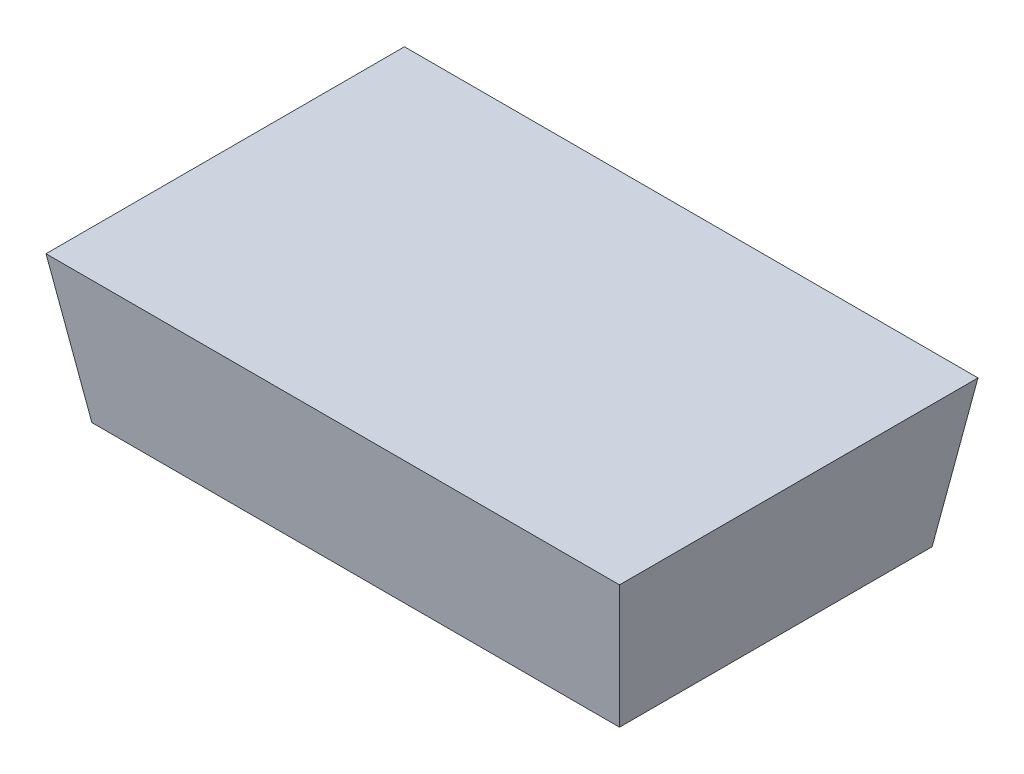
ISO-10303-21;
HEADER;
FILE_DESCRIPTION(('STEP AP214'),'2;1');
FILE_NAME('part.step','',(''),(''),'','','');
FILE_SCHEMA(('AUTOMOTIVE_DESIGN { 1 0 10303 214 1 1 1 1 }'));
ENDSEC;
DATA;
#1=APPLICATION_CONTEXT('core data for automotive mechanical design processes');
#2=APPLICATION_PROTOCOL_DEFINITION('international standard','automotive_design',2000,#1);
#3=PRODUCT_CONTEXT('',#1,'mechanical');
#4=PRODUCT('Part','Part','',(#3));
#5=PRODUCT_RELATED_PRODUCT_CATEGORY('part','',(#4));
#6=PRODUCT_DEFINITION_FORMATION('','',#4);
#7=PRODUCT_DEFINITION_CONTEXT('part definition',#1,'design');
#8=PRODUCT_DEFINITION('design','',#6,#7);
#9=PRODUCT_DEFINITION_SHAPE('','',#8);
#10=(LENGTH_UNIT() NAMED_UNIT(*) SI_UNIT(.MILLI.,.METRE.));
#11=(NAMED_UNIT(*) PLANE_ANGLE_UNIT() SI_UNIT($,.RADIAN.));
#12=(NAMED_UNIT(*) SI_UNIT($,.STERADIAN.) SOLID_ANGLE_UNIT());
#13=UNCERTAINTY_MEASURE_WITH_UNIT(LENGTH_MEASURE(1.E-05),#10,'distance_accuracy_value','');
#14=(GEOMETRIC_REPRESENTATION_CONTEXT(3) GLOBAL_UNCERTAINTY_ASSIGNED_CONTEXT((#13)) GLOBAL_UNIT_ASSIGNED_CONTEXT((#10,
#11,#12)) REPRESENTATION_CONTEXT('',''));
#15=CARTESIAN_POINT('',(0.,0.,0.));
#16=DIRECTION('',(0.,0.,1.));
#17=DIRECTION('',(1.,0.,0.));
#18=AXIS2_PLACEMENT_3D('',#15,#16,#17);
#19=CARTESIAN_POINT('',(0.,0.09500000000001,0.));
#20=DIRECTION('',(0.,1.,0.));
#21=DIRECTION('',(0.,0.,-1.));
#22=AXIS2_PLACEMENT_3D('',#19,#20,#21);
#23=PLANE('',#22);
#24=DIRECTION('',(1.,0.,0.));
#25=VECTOR('',#24,1.);
#26=CARTESIAN_POINT('',(0.,0.09500000000001,0.625));
#27=LINE('',#26,#25);
#28=CARTESIAN_POINT('',(-1.,0.09500000000001,0.625));
#29=VERTEX_POINT('',#28);
#30=CARTESIAN_POINT('',(1.,0.09500000000001,0.625));
#31=VERTEX_POINT('',#30);
#32=EDGE_CURVE('E26',#29,#31,#27,.T.);
#33=ORIENTED_EDGE('',*,*,#32,.T.);
#34=DIRECTION('',(0.,0.,-1.));
#35=VECTOR('',#34,1.);
#36=CARTESIAN_POINT('',(1.,0.09500000000001,0.));
#37=LINE('',#36,#35);
#38=CARTESIAN_POINT('',(1.,0.09500000000001,-0.625));
#39=VERTEX_POINT('',#38);
#40=EDGE_CURVE('E11',#31,#39,#37,.T.);
#41=ORIENTED_EDGE('',*,*,#40,.T.);
#42=DIRECTION('',(-1.,0.,0.));
#43=VECTOR('',#42,1.);
#44=CARTESIAN_POINT('',(0.,0.09500000000001,-0.625));
#45=LINE('',#44,#43);
#46=CARTESIAN_POINT('',(-1.,0.09500000000001,-0.625));
#47=VERTEX_POINT('',#46);
#48=EDGE_CURVE('E71',#39,#47,#45,.T.);
#49=ORIENTED_EDGE('',*,*,#48,.T.);
#50=DIRECTION('',(0.,0.,1.));
#51=VECTOR('',#50,1.);
#52=CARTESIAN_POINT('',(-1.,0.09500000000001,0.));
#53=LINE('',#52,#51);
#54=EDGE_CURVE('E65',#47,#29,#53,.T.);
#55=ORIENTED_EDGE('',*,*,#54,.T.);
#56=EDGE_LOOP('',(#33,#41,#49,#55));
#57=FACE_BOUND('',#56,.T.);
#58=ADVANCED_FACE('F16',(#57),#23,.T.);
#59=CARTESIAN_POINT('',(0.96,-0.16,0.));
#60=DIRECTION('',(0.987919526388253,-0.15496776884504,0.));
#61=DIRECTION('',(0.,0.,-1.));
#62=AXIS2_PLACEMENT_3D('',#59,#60,#61);
#63=PLANE('',#62);
#64=DIRECTION('',(0.,0.,-1.));
#65=VECTOR('',#64,1.);
#66=CARTESIAN_POINT('',(0.92,-0.415,0.));
#67=LINE('',#66,#65);
#68=CARTESIAN_POINT('',(0.92,-0.415,0.545));
#69=VERTEX_POINT('',#68);
#70=CARTESIAN_POINT('',(0.92,-0.415,-0.545));
#71=VERTEX_POINT('',#70);
#72=EDGE_CURVE('E78',#69,#71,#67,.T.);
#73=ORIENTED_EDGE('',*,*,#72,.T.);
#74=DIRECTION('',(0.153139850631055,0.976266547771353,-0.153139850631055));
#75=VECTOR('',#74,1.);
#76=CARTESIAN_POINT('',(0.92,-0.415,-0.545));
#77=LINE('',#76,#75);
#78=EDGE_CURVE('E75',#71,#39,#77,.T.);
#79=ORIENTED_EDGE('',*,*,#78,.T.);
#80=ORIENTED_EDGE('',*,*,#40,.F.);
#81=DIRECTION('',(-0.153139850631055,-0.976266547771353,-0.153139850631055));
#82=VECTOR('',#81,1.);
#83=CARTESIAN_POINT('',(1.,0.09500000000001,0.625));
#84=LINE('',#83,#82);
#85=EDGE_CURVE('E101',#31,#69,#84,.T.);
#86=ORIENTED_EDGE('',*,*,#85,.T.);
#87=EDGE_LOOP('',(#73,#79,#80,#86));
#88=FACE_BOUND('',#87,.T.);
#89=ADVANCED_FACE('F76',(#88),#63,.T.);
#90=CARTESIAN_POINT('',(0.,-0.16,0.585));
#91=DIRECTION('',(0.,-0.15496776884504,0.987919526388253));
#92=DIRECTION('',(-1.,0.,0.));
#93=AXIS2_PLACEMENT_3D('',#90,#91,#92);
#94=PLANE('',#93);
#95=DIRECTION('',(1.,0.,0.));
#96=VECTOR('',#95,1.);
#97=CARTESIAN_POINT('',(0.,-0.415,0.545));
#98=LINE('',#97,#96);
#99=CARTESIAN_POINT('',(-0.92,-0.415,0.545));
#100=VERTEX_POINT('',#99);
#101=EDGE_CURVE('E96',#100,#69,#98,.T.);
#102=ORIENTED_EDGE('',*,*,#101,.T.);
#103=ORIENTED_EDGE('',*,*,#85,.F.);
#104=ORIENTED_EDGE('',*,*,#32,.F.);
#105=DIRECTION('',(0.153139850631055,-0.976266547771353,-0.153139850631055));
#106=VECTOR('',#105,1.);
#107=CARTESIAN_POINT('',(-1.,0.09500000000001,0.625));
#108=LINE('',#107,#106);
#109=EDGE_CURVE('E83',#29,#100,#108,.T.);
#110=ORIENTED_EDGE('',*,*,#109,.T.);
#111=EDGE_LOOP('',(#102,#103,#104,#110));
#112=FACE_BOUND('',#111,.T.);
#113=ADVANCED_FACE('F120',(#112),#94,.T.);
#114=CARTESIAN_POINT('',(-0.96,-0.16,0.));
#115=DIRECTION('',(-0.987919526388253,-0.15496776884504,0.));
#116=DIRECTION('',(-0.15496776884504,0.987919526388253,0.));
#117=AXIS2_PLACEMENT_3D('',#114,#115,#116);
#118=PLANE('',#117);
#119=DIRECTION('',(0.,0.,1.));
#120=VECTOR('',#119,1.);
#121=CARTESIAN_POINT('',(-0.92,-0.415,0.));
#122=LINE('',#121,#120);
#123=CARTESIAN_POINT('',(-0.92,-0.415,-0.545));
#124=VERTEX_POINT('',#123);
#125=EDGE_CURVE('E19',#124,#100,#122,.T.);
#126=ORIENTED_EDGE('',*,*,#125,.T.);
#127=ORIENTED_EDGE('',*,*,#109,.F.);
#128=ORIENTED_EDGE('',*,*,#54,.F.);
#129=DIRECTION('',(0.153139850631055,-0.976266547771353,0.153139850631055));
#130=VECTOR('',#129,1.);
#131=CARTESIAN_POINT('',(-1.,0.09500000000001,-0.625));
#132=LINE('',#131,#130);
#133=EDGE_CURVE('E86',#47,#124,#132,.T.);
#134=ORIENTED_EDGE('',*,*,#133,.T.);
#135=EDGE_LOOP('',(#126,#127,#128,#134));
#136=FACE_BOUND('',#135,.T.);
#137=ADVANCED_FACE('F129',(#136),#118,.T.);
#138=CARTESIAN_POINT('',(0.,-0.16,-0.585));
#139=DIRECTION('',(0.,-0.15496776884504,-0.987919526388253));
#140=DIRECTION('',(0.,-0.987919526388253,0.15496776884504));
#141=AXIS2_PLACEMENT_3D('',#138,#139,#140);
#142=PLANE('',#141);
#143=DIRECTION('',(-1.,0.,0.));
#144=VECTOR('',#143,1.);
#145=CARTESIAN_POINT('',(0.,-0.415,-0.545));
#146=LINE('',#145,#144);
#147=EDGE_CURVE('E93',#71,#124,#146,.T.);
#148=ORIENTED_EDGE('',*,*,#147,.T.);
#149=ORIENTED_EDGE('',*,*,#133,.F.);
#150=ORIENTED_EDGE('',*,*,#48,.F.);
#151=ORIENTED_EDGE('',*,*,#78,.F.);
#152=EDGE_LOOP('',(#148,#149,#150,#151));
#153=FACE_BOUND('',#152,.T.);
#154=ADVANCED_FACE('F85',(#153),#142,.T.);
#155=CARTESIAN_POINT('',(0.,-0.415,0.));
#156=DIRECTION('',(0.,1.,0.));
#157=DIRECTION('',(0.,0.,-1.));
#158=AXIS2_PLACEMENT_3D('',#155,#156,#157);
#159=PLANE('',#158);
#160=ORIENTED_EDGE('',*,*,#72,.F.);
#161=ORIENTED_EDGE('',*,*,#101,.F.);
#162=ORIENTED_EDGE('',*,*,#125,.F.);
#163=ORIENTED_EDGE('',*,*,#147,.F.);
#164=EDGE_LOOP('',(#160,#161,#162,#163));
#165=FACE_BOUND('',#164,.T.);
#166=ADVANCED_FACE('F122',(#165),#159,.F.);
#167=CLOSED_SHELL('',(#58,#89,#113,#137,#154,#166));
#168=MANIFOLD_SOLID_BREP('B1',#167);
#169=ADVANCED_BREP_SHAPE_REPRESENTATION('',(#18,#168),#14);
#170=SHAPE_DEFINITION_REPRESENTATION(#9,#169);
ENDSEC;
END-ISO-10303-21;
